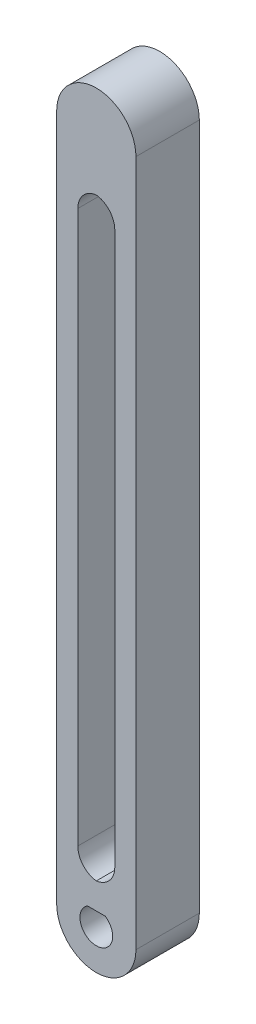
ISO-10303-21;
HEADER;
FILE_DESCRIPTION(('STEP AP214'),'2;1');
FILE_NAME('part.step','',(''),(''),'','','');
FILE_SCHEMA(('AUTOMOTIVE_DESIGN { 1 0 10303 214 1 1 1 1 }'));
ENDSEC;
DATA;
#1=APPLICATION_CONTEXT('core data for automotive mechanical design processes');
#2=APPLICATION_PROTOCOL_DEFINITION('international standard','automotive_design',2000,#1);
#3=PRODUCT_CONTEXT('',#1,'mechanical');
#4=PRODUCT('Part','Part','',(#3));
#5=PRODUCT_RELATED_PRODUCT_CATEGORY('part','',(#4));
#6=PRODUCT_DEFINITION_FORMATION('','',#4);
#7=PRODUCT_DEFINITION_CONTEXT('part definition',#1,'design');
#8=PRODUCT_DEFINITION('design','',#6,#7);
#9=PRODUCT_DEFINITION_SHAPE('','',#8);
#10=(LENGTH_UNIT() NAMED_UNIT(*) SI_UNIT(.MILLI.,.METRE.));
#11=(NAMED_UNIT(*) PLANE_ANGLE_UNIT() SI_UNIT($,.RADIAN.));
#12=(NAMED_UNIT(*) SI_UNIT($,.STERADIAN.) SOLID_ANGLE_UNIT());
#13=UNCERTAINTY_MEASURE_WITH_UNIT(LENGTH_MEASURE(1.E-05),#10,'distance_accuracy_value','');
#14=(GEOMETRIC_REPRESENTATION_CONTEXT(3) GLOBAL_UNCERTAINTY_ASSIGNED_CONTEXT((#13)) GLOBAL_UNIT_ASSIGNED_CONTEXT((#10,
#11,#12)) REPRESENTATION_CONTEXT('',''));
#15=CARTESIAN_POINT('',(0.,0.,0.));
#16=DIRECTION('',(0.,0.,1.));
#17=DIRECTION('',(1.,0.,0.));
#18=AXIS2_PLACEMENT_3D('',#15,#16,#17);
#19=CARTESIAN_POINT('',(1.85483870967741,102.58064516129,12.));
#20=DIRECTION('',(0.,0.,-1.));
#21=DIRECTION('',(-1.,0.,0.));
#22=AXIS2_PLACEMENT_3D('',#19,#20,#21);
#23=CYLINDRICAL_SURFACE('',#22,7.5);
#24=CARTESIAN_POINT('',(1.85483870967741,102.58064516129,0.));
#25=DIRECTION('',(0.,0.,1.));
#26=DIRECTION('',(-1.,0.,0.));
#27=AXIS2_PLACEMENT_3D('',#24,#25,#26);
#28=CIRCLE('',#27,7.5);
#29=CARTESIAN_POINT('',(9.35483870967741,102.58064516129,0.));
#30=VERTEX_POINT('',#29);
#31=CARTESIAN_POINT('',(-5.64516129032259,102.58064516129,0.));
#32=VERTEX_POINT('',#31);
#33=EDGE_CURVE('E156',#30,#32,#28,.T.);
#34=ORIENTED_EDGE('',*,*,#33,.T.);
#35=DIRECTION('',(0.,0.,-1.));
#36=VECTOR('',#35,1.);
#37=CARTESIAN_POINT('',(-5.64516129032259,102.58064516129,12.));
#38=LINE('',#37,#36);
#39=CARTESIAN_POINT('',(-5.64516129032259,102.58064516129,12.));
#40=VERTEX_POINT('',#39);
#41=EDGE_CURVE('E208',#40,#32,#38,.T.);
#42=ORIENTED_EDGE('',*,*,#41,.F.);
#43=CARTESIAN_POINT('',(1.85483870967741,102.58064516129,12.));
#44=DIRECTION('',(0.,0.,1.));
#45=DIRECTION('',(-1.,0.,0.));
#46=AXIS2_PLACEMENT_3D('',#43,#44,#45);
#47=CIRCLE('',#46,7.5);
#48=CARTESIAN_POINT('',(9.35483870967741,102.58064516129,12.));
#49=VERTEX_POINT('',#48);
#50=EDGE_CURVE('E171',#49,#40,#47,.T.);
#51=ORIENTED_EDGE('',*,*,#50,.F.);
#52=DIRECTION('',(0.,0.,-1.));
#53=VECTOR('',#52,1.);
#54=CARTESIAN_POINT('',(9.35483870967741,102.58064516129,12.));
#55=LINE('',#54,#53);
#56=EDGE_CURVE('E185',#49,#30,#55,.T.);
#57=ORIENTED_EDGE('',*,*,#56,.T.);
#58=EDGE_LOOP('',(#34,#42,#51,#57));
#59=FACE_BOUND('',#58,.T.);
#60=ADVANCED_FACE('F47',(#59),#23,.T.);
#61=CARTESIAN_POINT('',(-5.64516129032259,102.58064516129,12.));
#62=DIRECTION('',(1.,0.,0.));
#63=DIRECTION('',(0.,1.,0.));
#64=AXIS2_PLACEMENT_3D('',#61,#62,#63);
#65=PLANE('',#64);
#66=CARTESIAN_POINT('',(-5.64516129032259,78.768969581459,6.));
#67=DIRECTION('',(-1.,0.,0.));
#68=DIRECTION('',(0.,-1.,0.));
#69=AXIS2_PLACEMENT_3D('',#66,#67,#68);
#70=CIRCLE('',#69,5.15);
#71=CARTESIAN_POINT('',(-5.64516129032259,73.618969581459,6.));
#72=VERTEX_POINT('',#71);
#73=EDGE_CURVE('E460',#72,#72,#70,.T.);
#74=ORIENTED_EDGE('',*,*,#73,.F.);
#75=EDGE_LOOP('',(#74));
#76=FACE_BOUND('',#75,.T.);
#77=CARTESIAN_POINT('',(-5.64516129032258,53.768969581459,6.00000000000026));
#78=DIRECTION('',(-1.,0.,0.));
#79=DIRECTION('',(0.,-1.,0.));
#80=AXIS2_PLACEMENT_3D('',#77,#78,#79);
#81=CIRCLE('',#80,5.15);
#82=CARTESIAN_POINT('',(-5.64516129032258,48.618969581459,6.00000000000026));
#83=VERTEX_POINT('',#82);
#84=EDGE_CURVE('E464',#83,#83,#81,.T.);
#85=ORIENTED_EDGE('',*,*,#84,.F.);
#86=EDGE_LOOP('',(#85));
#87=FACE_BOUND('',#86,.T.);
#88=CARTESIAN_POINT('',(-5.64516129032258,28.768969581459,6.00000000000052));
#89=DIRECTION('',(-1.,0.,0.));
#90=DIRECTION('',(0.,-1.,0.));
#91=AXIS2_PLACEMENT_3D('',#88,#89,#90);
#92=CIRCLE('',#91,5.15);
#93=CARTESIAN_POINT('',(-5.64516129032258,23.618969581459,6.00000000000052));
#94=VERTEX_POINT('',#93);
#95=EDGE_CURVE('E254',#94,#94,#92,.T.);
#96=ORIENTED_EDGE('',*,*,#95,.F.);
#97=EDGE_LOOP('',(#96));
#98=FACE_BOUND('',#97,.T.);
#99=DIRECTION('',(0.,-1.,0.));
#100=VECTOR('',#99,1.);
#101=CARTESIAN_POINT('',(-5.64516129032259,102.58064516129,0.));
#102=LINE('',#101,#100);
#103=CARTESIAN_POINT('',(-5.64516129032258,-27.4193548387097,0.));
#104=VERTEX_POINT('',#103);
#105=EDGE_CURVE('E189',#32,#104,#102,.T.);
#106=ORIENTED_EDGE('',*,*,#105,.T.);
#107=DIRECTION('',(0.,0.,-1.));
#108=VECTOR('',#107,1.);
#109=CARTESIAN_POINT('',(-5.64516129032258,-27.4193548387097,12.));
#110=LINE('',#109,#108);
#111=CARTESIAN_POINT('',(-5.64516129032258,-27.4193548387097,12.));
#112=VERTEX_POINT('',#111);
#113=EDGE_CURVE('E204',#112,#104,#110,.T.);
#114=ORIENTED_EDGE('',*,*,#113,.F.);
#115=DIRECTION('',(0.,-1.,0.));
#116=VECTOR('',#115,1.);
#117=CARTESIAN_POINT('',(-5.64516129032259,102.58064516129,12.));
#118=LINE('',#117,#116);
#119=EDGE_CURVE('E175',#40,#112,#118,.T.);
#120=ORIENTED_EDGE('',*,*,#119,.F.);
#121=ORIENTED_EDGE('',*,*,#41,.T.);
#122=EDGE_LOOP('',(#106,#114,#120,#121));
#123=FACE_BOUND('',#122,.T.);
#124=ADVANCED_FACE('F308',(#76,#87,#98,#123),#65,.F.);
#125=CARTESIAN_POINT('',(1.85483870967743,-27.4193548387097,12.));
#126=DIRECTION('',(0.,0.,-1.));
#127=DIRECTION('',(-1.,0.,0.));
#128=AXIS2_PLACEMENT_3D('',#125,#126,#127);
#129=CYLINDRICAL_SURFACE('',#128,7.5);
#130=CARTESIAN_POINT('',(1.85483870967743,-27.4193548387097,0.));
#131=DIRECTION('',(0.,0.,1.));
#132=DIRECTION('',(1.,0.,0.));
#133=AXIS2_PLACEMENT_3D('',#130,#131,#132);
#134=CIRCLE('',#133,7.5);
#135=CARTESIAN_POINT('',(9.35483870967743,-27.4193548387097,0.));
#136=VERTEX_POINT('',#135);
#137=EDGE_CURVE('E192',#104,#136,#134,.T.);
#138=ORIENTED_EDGE('',*,*,#137,.T.);
#139=DIRECTION('',(0.,0.,-1.));
#140=VECTOR('',#139,1.);
#141=CARTESIAN_POINT('',(9.35483870967743,-27.4193548387097,12.));
#142=LINE('',#141,#140);
#143=CARTESIAN_POINT('',(9.35483870967743,-27.4193548387097,12.));
#144=VERTEX_POINT('',#143);
#145=EDGE_CURVE('E200',#144,#136,#142,.T.);
#146=ORIENTED_EDGE('',*,*,#145,.F.);
#147=CARTESIAN_POINT('',(1.85483870967743,-27.4193548387097,12.));
#148=DIRECTION('',(0.,0.,1.));
#149=DIRECTION('',(1.,0.,0.));
#150=AXIS2_PLACEMENT_3D('',#147,#148,#149);
#151=CIRCLE('',#150,7.5);
#152=EDGE_CURVE('E179',#112,#144,#151,.T.);
#153=ORIENTED_EDGE('',*,*,#152,.F.);
#154=ORIENTED_EDGE('',*,*,#113,.T.);
#155=EDGE_LOOP('',(#138,#146,#153,#154));
#156=FACE_BOUND('',#155,.T.);
#157=ADVANCED_FACE('F303',(#156),#129,.T.);
#158=CARTESIAN_POINT('',(9.35483870967741,102.58064516129,12.));
#159=DIRECTION('',(-1.,0.,0.));
#160=DIRECTION('',(0.,-1.,0.));
#161=AXIS2_PLACEMENT_3D('',#158,#159,#160);
#162=PLANE('',#161);
#163=DIRECTION('',(0.,1.,0.));
#164=VECTOR('',#163,1.);
#165=CARTESIAN_POINT('',(9.35483870967741,102.58064516129,0.));
#166=LINE('',#165,#164);
#167=EDGE_CURVE('E176',#136,#30,#166,.T.);
#168=ORIENTED_EDGE('',*,*,#167,.T.);
#169=ORIENTED_EDGE('',*,*,#56,.F.);
#170=DIRECTION('',(0.,1.,0.));
#171=VECTOR('',#170,1.);
#172=CARTESIAN_POINT('',(9.35483870967741,102.58064516129,12.));
#173=LINE('',#172,#171);
#174=EDGE_CURVE('E182',#144,#49,#173,.T.);
#175=ORIENTED_EDGE('',*,*,#174,.F.);
#176=ORIENTED_EDGE('',*,*,#145,.T.);
#177=EDGE_LOOP('',(#168,#169,#175,#176));
#178=FACE_BOUND('',#177,.T.);
#179=ADVANCED_FACE('F295',(#178),#162,.F.);
#180=CARTESIAN_POINT('',(1.85483870967741,102.58064516129,12.));
#181=DIRECTION('',(0.,0.,-1.));
#182=DIRECTION('',(-1.,0.,0.));
#183=AXIS2_PLACEMENT_3D('',#180,#181,#182);
#184=PLANE('',#183);
#185=DIRECTION('',(0.,1.,0.));
#186=VECTOR('',#185,1.);
#187=CARTESIAN_POINT('',(5.35483870967741,92.5806451612903,12.));
#188=LINE('',#187,#186);
#189=CARTESIAN_POINT('',(5.35483870967741,-15.9193548387097,12.));
#190=VERTEX_POINT('',#189);
#191=CARTESIAN_POINT('',(5.35483870967741,88.5806451612903,12.));
#192=VERTEX_POINT('',#191);
#193=EDGE_CURVE('E278',#190,#192,#188,.T.);
#194=ORIENTED_EDGE('',*,*,#193,.F.);
#195=CARTESIAN_POINT('',(1.35483870967741,-15.9193548387097,12.));
#196=DIRECTION('',(0.,0.,-1.));
#197=DIRECTION('',(-1.,0.,0.));
#198=AXIS2_PLACEMENT_3D('',#195,#196,#197);
#199=CIRCLE('',#198,4.);
#200=CARTESIAN_POINT('',(1.85483870967744,-19.8879818053066,12.));
#201=VERTEX_POINT('',#200);
#202=EDGE_CURVE('E232',#190,#201,#199,.T.);
#203=ORIENTED_EDGE('',*,*,#202,.T.);
#204=CARTESIAN_POINT('',(2.35483870967741,-15.9193548387097,12.));
#205=DIRECTION('',(0.,0.,-1.));
#206=DIRECTION('',(-1.,0.,0.));
#207=AXIS2_PLACEMENT_3D('',#204,#205,#206);
#208=CIRCLE('',#207,4.);
#209=CARTESIAN_POINT('',(-1.64516129032259,-15.9193548387097,12.));
#210=VERTEX_POINT('',#209);
#211=EDGE_CURVE('E226',#201,#210,#208,.T.);
#212=ORIENTED_EDGE('',*,*,#211,.T.);
#213=DIRECTION('',(0.,-1.,0.));
#214=VECTOR('',#213,1.);
#215=CARTESIAN_POINT('',(-1.64516129032259,92.5806451612903,12.));
#216=LINE('',#215,#214);
#217=CARTESIAN_POINT('',(-1.64516129032259,88.5806451612903,12.));
#218=VERTEX_POINT('',#217);
#219=EDGE_CURVE('E275',#218,#210,#216,.T.);
#220=ORIENTED_EDGE('',*,*,#219,.F.);
#221=CARTESIAN_POINT('',(2.35483870967741,88.5806451612903,12.));
#222=DIRECTION('',(0.,0.,-1.));
#223=DIRECTION('',(-1.,0.,0.));
#224=AXIS2_PLACEMENT_3D('',#221,#222,#223);
#225=CIRCLE('',#224,4.);
#226=CARTESIAN_POINT('',(1.85483870967741,92.5492721278872,12.));
#227=VERTEX_POINT('',#226);
#228=EDGE_CURVE('E57',#218,#227,#225,.T.);
#229=ORIENTED_EDGE('',*,*,#228,.T.);
#230=CARTESIAN_POINT('',(1.35483870967741,88.5806451612903,12.));
#231=DIRECTION('',(0.,0.,-1.));
#232=DIRECTION('',(-1.,0.,0.));
#233=AXIS2_PLACEMENT_3D('',#230,#231,#232);
#234=CIRCLE('',#233,4.);
#235=EDGE_CURVE('E238',#227,#192,#234,.T.);
#236=ORIENTED_EDGE('',*,*,#235,.T.);
#237=EDGE_LOOP('',(#194,#203,#212,#220,#229,#236));
#238=FACE_BOUND('',#237,.T.);
#239=CARTESIAN_POINT('',(1.85483870967743,-27.4193548387097,12.));
#240=DIRECTION('',(0.,0.,-1.));
#241=DIRECTION('',(-1.,0.,0.));
#242=AXIS2_PLACEMENT_3D('',#239,#240,#241);
#243=CIRCLE('',#242,3.1);
#244=CARTESIAN_POINT('',(3.54303301129084,-24.8193548387097,12.));
#245=VERTEX_POINT('',#244);
#246=CARTESIAN_POINT('',(0.166644408064011,-24.8193548387097,12.));
#247=VERTEX_POINT('',#246);
#248=EDGE_CURVE('E141',#245,#247,#243,.T.);
#249=ORIENTED_EDGE('',*,*,#248,.T.);
#250=DIRECTION('',(1.,0.,0.));
#251=VECTOR('',#250,1.);
#252=CARTESIAN_POINT('',(0.166644408064011,-24.8193548387097,12.));
#253=LINE('',#252,#251);
#254=EDGE_CURVE('E137',#247,#245,#253,.T.);
#255=ORIENTED_EDGE('',*,*,#254,.T.);
#256=EDGE_LOOP('',(#249,#255));
#257=FACE_BOUND('',#256,.T.);
#258=ORIENTED_EDGE('',*,*,#50,.T.);
#259=ORIENTED_EDGE('',*,*,#119,.T.);
#260=ORIENTED_EDGE('',*,*,#152,.T.);
#261=ORIENTED_EDGE('',*,*,#174,.T.);
#262=EDGE_LOOP('',(#258,#259,#260,#261));
#263=FACE_BOUND('',#262,.T.);
#264=ADVANCED_FACE('F139',(#238,#257,#263),#184,.F.);
#265=CARTESIAN_POINT('',(1.85483870967741,102.58064516129,0.));
#266=DIRECTION('',(0.,0.,-1.));
#267=DIRECTION('',(-1.,0.,0.));
#268=AXIS2_PLACEMENT_3D('',#265,#266,#267);
#269=PLANE('',#268);
#270=CARTESIAN_POINT('',(2.35483870967741,-15.9193548387097,0.));
#271=DIRECTION('',(0.,0.,-1.));
#272=DIRECTION('',(-1.,0.,0.));
#273=AXIS2_PLACEMENT_3D('',#270,#271,#272);
#274=CIRCLE('',#273,4.);
#275=CARTESIAN_POINT('',(-1.64516129032259,-15.9193548387097,0.));
#276=VERTEX_POINT('',#275);
#277=CARTESIAN_POINT('',(1.85483870967744,-19.8879818053066,0.));
#278=VERTEX_POINT('',#277);
#279=EDGE_CURVE('E229',#276,#278,#274,.F.);
#280=ORIENTED_EDGE('',*,*,#279,.T.);
#281=CARTESIAN_POINT('',(1.35483870967741,-15.9193548387097,0.));
#282=DIRECTION('',(0.,0.,-1.));
#283=DIRECTION('',(-1.,0.,0.));
#284=AXIS2_PLACEMENT_3D('',#281,#282,#283);
#285=CIRCLE('',#284,4.);
#286=CARTESIAN_POINT('',(5.35483870967741,-15.9193548387097,0.));
#287=VERTEX_POINT('',#286);
#288=EDGE_CURVE('E235',#278,#287,#285,.F.);
#289=ORIENTED_EDGE('',*,*,#288,.T.);
#290=DIRECTION('',(0.,1.,0.));
#291=VECTOR('',#290,1.);
#292=CARTESIAN_POINT('',(5.35483870967741,92.5806451612903,0.));
#293=LINE('',#292,#291);
#294=CARTESIAN_POINT('',(5.35483870967741,88.5806451612903,0.));
#295=VERTEX_POINT('',#294);
#296=EDGE_CURVE('E272',#287,#295,#293,.T.);
#297=ORIENTED_EDGE('',*,*,#296,.T.);
#298=CARTESIAN_POINT('',(1.35483870967741,88.5806451612903,0.));
#299=DIRECTION('',(0.,0.,-1.));
#300=DIRECTION('',(-1.,0.,0.));
#301=AXIS2_PLACEMENT_3D('',#298,#299,#300);
#302=CIRCLE('',#301,4.);
#303=CARTESIAN_POINT('',(1.85483870967741,92.5492721278872,0.));
#304=VERTEX_POINT('',#303);
#305=EDGE_CURVE('E64',#295,#304,#302,.F.);
#306=ORIENTED_EDGE('',*,*,#305,.T.);
#307=CARTESIAN_POINT('',(2.35483870967741,88.5806451612903,0.));
#308=DIRECTION('',(0.,0.,-1.));
#309=DIRECTION('',(-1.,0.,0.));
#310=AXIS2_PLACEMENT_3D('',#307,#308,#309);
#311=CIRCLE('',#310,4.);
#312=CARTESIAN_POINT('',(-1.64516129032259,88.5806451612903,0.));
#313=VERTEX_POINT('',#312);
#314=EDGE_CURVE('E11',#304,#313,#311,.F.);
#315=ORIENTED_EDGE('',*,*,#314,.T.);
#316=DIRECTION('',(0.,-1.,0.));
#317=VECTOR('',#316,1.);
#318=CARTESIAN_POINT('',(-1.64516129032259,92.5806451612903,0.));
#319=LINE('',#318,#317);
#320=EDGE_CURVE('E147',#313,#276,#319,.T.);
#321=ORIENTED_EDGE('',*,*,#320,.T.);
#322=EDGE_LOOP('',(#280,#289,#297,#306,#315,#321));
#323=FACE_BOUND('',#322,.T.);
#324=CARTESIAN_POINT('',(1.85483870967743,-27.4193548387097,0.));
#325=DIRECTION('',(0.,0.,-1.));
#326=DIRECTION('',(-1.,0.,0.));
#327=AXIS2_PLACEMENT_3D('',#324,#325,#326);
#328=CIRCLE('',#327,3.1);
#329=CARTESIAN_POINT('',(3.54303301129084,-24.8193548387097,0.));
#330=VERTEX_POINT('',#329);
#331=CARTESIAN_POINT('',(0.166644408064011,-24.8193548387097,0.));
#332=VERTEX_POINT('',#331);
#333=EDGE_CURVE('E157',#330,#332,#328,.T.);
#334=ORIENTED_EDGE('',*,*,#333,.F.);
#335=DIRECTION('',(1.,0.,0.));
#336=VECTOR('',#335,1.);
#337=CARTESIAN_POINT('',(1.85483870967741,-24.8193548387097,0.));
#338=LINE('',#337,#336);
#339=EDGE_CURVE('E161',#332,#330,#338,.T.);
#340=ORIENTED_EDGE('',*,*,#339,.F.);
#341=EDGE_LOOP('',(#334,#340));
#342=FACE_BOUND('',#341,.T.);
#343=ORIENTED_EDGE('',*,*,#33,.F.);
#344=ORIENTED_EDGE('',*,*,#167,.F.);
#345=ORIENTED_EDGE('',*,*,#137,.F.);
#346=ORIENTED_EDGE('',*,*,#105,.F.);
#347=EDGE_LOOP('',(#343,#344,#345,#346));
#348=FACE_BOUND('',#347,.T.);
#349=ADVANCED_FACE('F265',(#323,#342,#348),#269,.T.);
#350=CARTESIAN_POINT('',(1.85483870967743,-27.4193548387097,-23.));
#351=DIRECTION('',(0.,0.,1.));
#352=DIRECTION('',(1.,0.,0.));
#353=AXIS2_PLACEMENT_3D('',#350,#351,#352);
#354=CYLINDRICAL_SURFACE('',#353,3.1);
#355=DIRECTION('',(0.,0.,1.));
#356=VECTOR('',#355,1.);
#357=CARTESIAN_POINT('',(3.54303301129084,-24.8193548387097,-23.));
#358=LINE('',#357,#356);
#359=EDGE_CURVE('E146',#330,#245,#358,.T.);
#360=ORIENTED_EDGE('',*,*,#359,.F.);
#361=ORIENTED_EDGE('',*,*,#333,.T.);
#362=DIRECTION('',(0.,0.,1.));
#363=VECTOR('',#362,1.);
#364=CARTESIAN_POINT('',(0.166644408064011,-24.8193548387097,-23.));
#365=LINE('',#364,#363);
#366=EDGE_CURVE('E154',#332,#247,#365,.T.);
#367=ORIENTED_EDGE('',*,*,#366,.T.);
#368=ORIENTED_EDGE('',*,*,#248,.F.);
#369=EDGE_LOOP('',(#360,#361,#367,#368));
#370=FACE_BOUND('',#369,.T.);
#371=ADVANCED_FACE('F151',(#370),#354,.F.);
#372=CARTESIAN_POINT('',(0.166644408064011,-24.8193548387097,-23.));
#373=DIRECTION('',(0.,1.,0.));
#374=DIRECTION('',(0.,0.,1.));
#375=AXIS2_PLACEMENT_3D('',#372,#373,#374);
#376=PLANE('',#375);
#377=ORIENTED_EDGE('',*,*,#359,.T.);
#378=ORIENTED_EDGE('',*,*,#254,.F.);
#379=ORIENTED_EDGE('',*,*,#366,.F.);
#380=ORIENTED_EDGE('',*,*,#339,.T.);
#381=EDGE_LOOP('',(#377,#378,#379,#380));
#382=FACE_BOUND('',#381,.T.);
#383=ADVANCED_FACE('F159',(#382),#376,.F.);
#384=CARTESIAN_POINT('',(-1.64516129032259,92.5806451612903,0.));
#385=DIRECTION('',(-1.,0.,0.));
#386=DIRECTION('',(0.,-1.,0.));
#387=AXIS2_PLACEMENT_3D('',#384,#385,#386);
#388=PLANE('',#387);
#389=ORIENTED_EDGE('',*,*,#219,.T.);
#390=DIRECTION('',(0.,0.,1.));
#391=VECTOR('',#390,1.);
#392=CARTESIAN_POINT('',(-1.64516129032259,-15.9193548387097,0.));
#393=LINE('',#392,#391);
#394=EDGE_CURVE('E215',#210,#276,#393,.F.);
#395=ORIENTED_EDGE('',*,*,#394,.T.);
#396=ORIENTED_EDGE('',*,*,#320,.F.);
#397=DIRECTION('',(0.,0.,1.));
#398=VECTOR('',#397,1.);
#399=CARTESIAN_POINT('',(-1.64516129032259,88.5806451612903,12.));
#400=LINE('',#399,#398);
#401=EDGE_CURVE('E212',#313,#218,#400,.T.);
#402=ORIENTED_EDGE('',*,*,#401,.T.);
#403=EDGE_LOOP('',(#389,#395,#396,#402));
#404=FACE_BOUND('',#403,.T.);
#405=ADVANCED_FACE('F269',(#404),#388,.F.);
#406=CARTESIAN_POINT('',(5.35483870967741,92.5806451612903,0.));
#407=DIRECTION('',(1.,0.,0.));
#408=DIRECTION('',(0.,0.,-1.));
#409=AXIS2_PLACEMENT_3D('',#406,#407,#408);
#410=PLANE('',#409);
#411=ORIENTED_EDGE('',*,*,#296,.F.);
#412=DIRECTION('',(0.,0.,1.));
#413=VECTOR('',#412,1.);
#414=CARTESIAN_POINT('',(5.35483870967741,-15.9193548387097,12.));
#415=LINE('',#414,#413);
#416=EDGE_CURVE('E223',#287,#190,#415,.T.);
#417=ORIENTED_EDGE('',*,*,#416,.T.);
#418=ORIENTED_EDGE('',*,*,#193,.T.);
#419=DIRECTION('',(0.,0.,1.));
#420=VECTOR('',#419,1.);
#421=CARTESIAN_POINT('',(5.35483870967741,88.5806451612903,0.));
#422=LINE('',#421,#420);
#423=EDGE_CURVE('E219',#192,#295,#422,.F.);
#424=ORIENTED_EDGE('',*,*,#423,.T.);
#425=EDGE_LOOP('',(#411,#417,#418,#424));
#426=FACE_BOUND('',#425,.T.);
#427=ADVANCED_FACE('F293',(#426),#410,.F.);
#428=CARTESIAN_POINT('',(-3.64516129032258,28.768969581459,6.00000000000052));
#429=DIRECTION('',(-1.,0.,0.));
#430=DIRECTION('',(0.,-1.,0.));
#431=AXIS2_PLACEMENT_3D('',#428,#429,#430);
#432=CYLINDRICAL_SURFACE('',#431,5.15);
#433=CARTESIAN_POINT('',(-3.64516129032258,28.768969581459,6.00000000000052));
#434=DIRECTION('',(-1.,0.,0.));
#435=DIRECTION('',(0.,-1.,0.));
#436=AXIS2_PLACEMENT_3D('',#433,#434,#435);
#437=CIRCLE('',#436,5.15);
#438=CARTESIAN_POINT('',(-3.64516129032258,23.618969581459,6.00000000000052));
#439=VERTEX_POINT('',#438);
#440=EDGE_CURVE('E247',#439,#439,#437,.T.);
#441=ORIENTED_EDGE('',*,*,#440,.F.);
#442=EDGE_LOOP('',(#441));
#443=FACE_BOUND('',#442,.T.);
#444=ORIENTED_EDGE('',*,*,#95,.T.);
#445=EDGE_LOOP('',(#444));
#446=FACE_BOUND('',#445,.T.);
#447=ADVANCED_FACE('F347',(#443,#446),#432,.F.);
#448=CARTESIAN_POINT('',(-3.64516129032258,28.768969581459,6.00000000000052));
#449=DIRECTION('',(-1.,0.,0.));
#450=DIRECTION('',(0.,-1.,0.));
#451=AXIS2_PLACEMENT_3D('',#448,#449,#450);
#452=PLANE('',#451);
#453=ORIENTED_EDGE('',*,*,#440,.T.);
#454=EDGE_LOOP('',(#453));
#455=FACE_BOUND('',#454,.T.);
#456=ADVANCED_FACE('F396',(#455),#452,.T.);
#457=CARTESIAN_POINT('',(-3.64516129032258,53.768969581459,6.00000000000026));
#458=DIRECTION('',(-1.,0.,0.));
#459=DIRECTION('',(0.,-1.,0.));
#460=AXIS2_PLACEMENT_3D('',#457,#458,#459);
#461=CYLINDRICAL_SURFACE('',#460,5.15);
#462=CARTESIAN_POINT('',(-3.64516129032258,53.768969581459,6.00000000000026));
#463=DIRECTION('',(-1.,0.,0.));
#464=DIRECTION('',(0.,-1.,0.));
#465=AXIS2_PLACEMENT_3D('',#462,#463,#464);
#466=CIRCLE('',#465,5.15);
#467=CARTESIAN_POINT('',(-3.64516129032258,48.618969581459,6.00000000000026));
#468=VERTEX_POINT('',#467);
#469=EDGE_CURVE('E470',#468,#468,#466,.T.);
#470=ORIENTED_EDGE('',*,*,#469,.F.);
#471=EDGE_LOOP('',(#470));
#472=FACE_BOUND('',#471,.T.);
#473=ORIENTED_EDGE('',*,*,#84,.T.);
#474=EDGE_LOOP('',(#473));
#475=FACE_BOUND('',#474,.T.);
#476=ADVANCED_FACE('F405',(#472,#475),#461,.F.);
#477=CARTESIAN_POINT('',(-3.64516129032258,53.768969581459,6.00000000000026));
#478=DIRECTION('',(-1.,0.,0.));
#479=DIRECTION('',(0.,-1.,0.));
#480=AXIS2_PLACEMENT_3D('',#477,#478,#479);
#481=PLANE('',#480);
#482=ORIENTED_EDGE('',*,*,#469,.T.);
#483=EDGE_LOOP('',(#482));
#484=FACE_BOUND('',#483,.T.);
#485=ADVANCED_FACE('F414',(#484),#481,.T.);
#486=CARTESIAN_POINT('',(-3.64516129032259,78.768969581459,6.));
#487=DIRECTION('',(-1.,0.,0.));
#488=DIRECTION('',(0.,-1.,0.));
#489=AXIS2_PLACEMENT_3D('',#486,#487,#488);
#490=CYLINDRICAL_SURFACE('',#489,5.15);
#491=CARTESIAN_POINT('',(-3.64516129032259,78.768969581459,6.));
#492=DIRECTION('',(-1.,0.,0.));
#493=DIRECTION('',(0.,-1.,0.));
#494=AXIS2_PLACEMENT_3D('',#491,#492,#493);
#495=CIRCLE('',#494,5.15);
#496=CARTESIAN_POINT('',(-3.64516129032259,73.618969581459,6.));
#497=VERTEX_POINT('',#496);
#498=EDGE_CURVE('E282',#497,#497,#495,.T.);
#499=ORIENTED_EDGE('',*,*,#498,.F.);
#500=EDGE_LOOP('',(#499));
#501=FACE_BOUND('',#500,.T.);
#502=ORIENTED_EDGE('',*,*,#73,.T.);
#503=EDGE_LOOP('',(#502));
#504=FACE_BOUND('',#503,.T.);
#505=ADVANCED_FACE('F423',(#501,#504),#490,.F.);
#506=CARTESIAN_POINT('',(-3.64516129032259,78.768969581459,6.));
#507=DIRECTION('',(-1.,0.,0.));
#508=DIRECTION('',(0.,-1.,0.));
#509=AXIS2_PLACEMENT_3D('',#506,#507,#508);
#510=PLANE('',#509);
#511=ORIENTED_EDGE('',*,*,#498,.T.);
#512=EDGE_LOOP('',(#511));
#513=FACE_BOUND('',#512,.T.);
#514=ADVANCED_FACE('F322',(#513),#510,.T.);
#515=CARTESIAN_POINT('',(1.35483870967741,-15.9193548387097,0.));
#516=DIRECTION('',(0.,0.,-1.));
#517=DIRECTION('',(-1.,0.,0.));
#518=AXIS2_PLACEMENT_3D('',#515,#516,#517);
#519=CYLINDRICAL_SURFACE('',#518,4.);
#520=ORIENTED_EDGE('',*,*,#416,.F.);
#521=ORIENTED_EDGE('',*,*,#288,.F.);
#522=DIRECTION('',(0.,0.,-1.));
#523=VECTOR('',#522,1.);
#524=CARTESIAN_POINT('',(1.85483870967744,-19.8879818053066,6.));
#525=LINE('',#524,#523);
#526=EDGE_CURVE('E244',#201,#278,#525,.T.);
#527=ORIENTED_EDGE('',*,*,#526,.F.);
#528=ORIENTED_EDGE('',*,*,#202,.F.);
#529=EDGE_LOOP('',(#520,#521,#527,#528));
#530=FACE_BOUND('',#529,.T.);
#531=ADVANCED_FACE('F289',(#530),#519,.F.);
#532=CARTESIAN_POINT('',(2.35483870967741,-15.9193548387097,0.));
#533=DIRECTION('',(0.,0.,-1.));
#534=DIRECTION('',(-1.,0.,0.));
#535=AXIS2_PLACEMENT_3D('',#532,#533,#534);
#536=CYLINDRICAL_SURFACE('',#535,4.);
#537=ORIENTED_EDGE('',*,*,#279,.F.);
#538=ORIENTED_EDGE('',*,*,#394,.F.);
#539=ORIENTED_EDGE('',*,*,#211,.F.);
#540=ORIENTED_EDGE('',*,*,#526,.T.);
#541=EDGE_LOOP('',(#537,#538,#539,#540));
#542=FACE_BOUND('',#541,.T.);
#543=ADVANCED_FACE('F284',(#542),#536,.F.);
#544=CARTESIAN_POINT('',(2.35483870967741,88.5806451612903,0.));
#545=DIRECTION('',(0.,0.,-1.));
#546=DIRECTION('',(-1.,0.,0.));
#547=AXIS2_PLACEMENT_3D('',#544,#545,#546);
#548=CYLINDRICAL_SURFACE('',#547,4.);
#549=ORIENTED_EDGE('',*,*,#401,.F.);
#550=ORIENTED_EDGE('',*,*,#314,.F.);
#551=DIRECTION('',(0.,0.,-1.));
#552=VECTOR('',#551,1.);
#553=CARTESIAN_POINT('',(1.85483870967741,92.5492721278872,6.));
#554=LINE('',#553,#552);
#555=EDGE_CURVE('E51',#227,#304,#554,.T.);
#556=ORIENTED_EDGE('',*,*,#555,.F.);
#557=ORIENTED_EDGE('',*,*,#228,.F.);
#558=EDGE_LOOP('',(#549,#550,#556,#557));
#559=FACE_BOUND('',#558,.T.);
#560=ADVANCED_FACE('F49',(#559),#548,.F.);
#561=CARTESIAN_POINT('',(1.35483870967741,88.5806451612903,0.));
#562=DIRECTION('',(0.,0.,-1.));
#563=DIRECTION('',(-1.,0.,0.));
#564=AXIS2_PLACEMENT_3D('',#561,#562,#563);
#565=CYLINDRICAL_SURFACE('',#564,4.);
#566=ORIENTED_EDGE('',*,*,#305,.F.);
#567=ORIENTED_EDGE('',*,*,#423,.F.);
#568=ORIENTED_EDGE('',*,*,#235,.F.);
#569=ORIENTED_EDGE('',*,*,#555,.T.);
#570=EDGE_LOOP('',(#566,#567,#568,#569));
#571=FACE_BOUND('',#570,.T.);
#572=ADVANCED_FACE('F259',(#571),#565,.F.);
#573=CLOSED_SHELL('',(#60,#124,#157,#179,#264,#349,#371,#383,#405,#427,#447,#456,#476,#485,#505,
#514,#531,#543,#560,#572));
#574=MANIFOLD_SOLID_BREP('B2',#573);
#575=ADVANCED_BREP_SHAPE_REPRESENTATION('',(#18,#574),#14);
#576=SHAPE_DEFINITION_REPRESENTATION(#9,#575);
ENDSEC;
END-ISO-10303-21;
